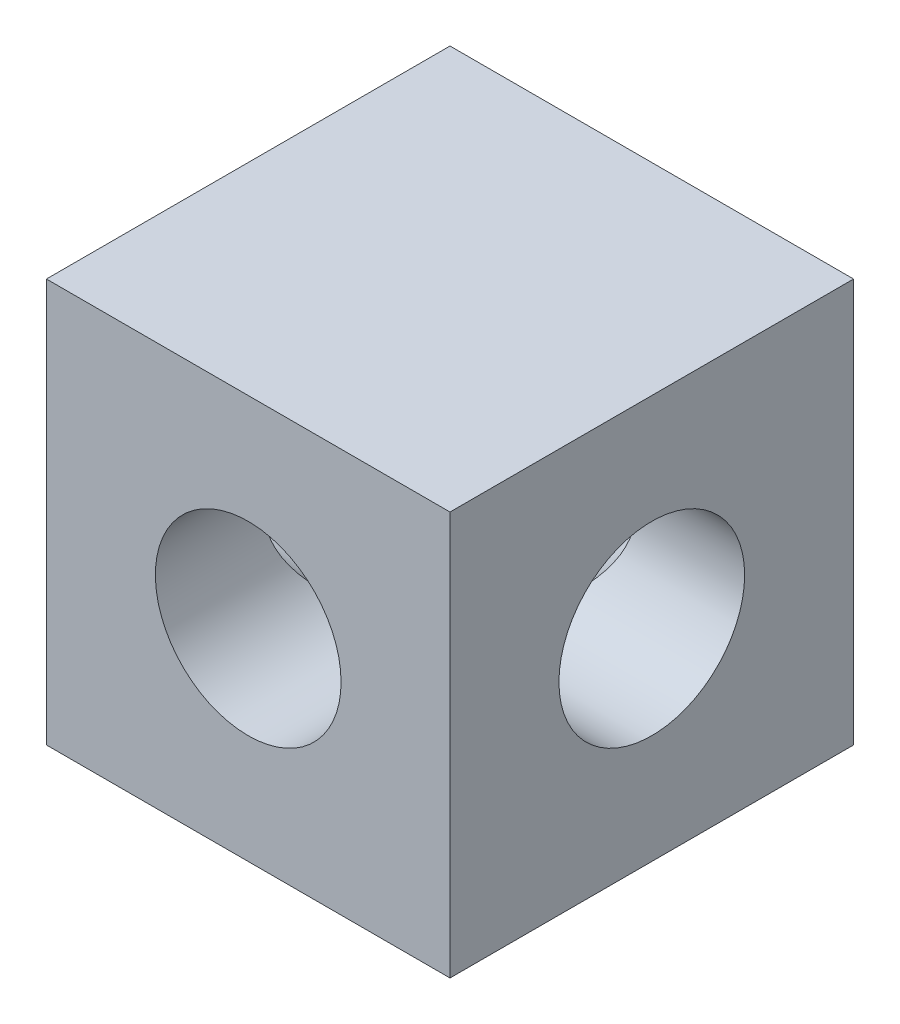
ISO-10303-21;
HEADER;
FILE_DESCRIPTION(('STEP AP214'),'2;1');
FILE_NAME('part.step','',(''),(''),'','','');
FILE_SCHEMA(('AUTOMOTIVE_DESIGN { 1 0 10303 214 1 1 1 1 }'));
ENDSEC;
DATA;
#1=APPLICATION_CONTEXT('core data for automotive mechanical design processes');
#2=APPLICATION_PROTOCOL_DEFINITION('international standard','automotive_design',2000,#1);
#3=PRODUCT_CONTEXT('',#1,'mechanical');
#4=PRODUCT('Part','Part','',(#3));
#5=PRODUCT_RELATED_PRODUCT_CATEGORY('part','',(#4));
#6=PRODUCT_DEFINITION_FORMATION('','',#4);
#7=PRODUCT_DEFINITION_CONTEXT('part definition',#1,'design');
#8=PRODUCT_DEFINITION('design','',#6,#7);
#9=PRODUCT_DEFINITION_SHAPE('','',#8);
#10=(LENGTH_UNIT() NAMED_UNIT(*) SI_UNIT(.MILLI.,.METRE.));
#11=(NAMED_UNIT(*) PLANE_ANGLE_UNIT() SI_UNIT($,.RADIAN.));
#12=(NAMED_UNIT(*) SI_UNIT($,.STERADIAN.) SOLID_ANGLE_UNIT());
#13=UNCERTAINTY_MEASURE_WITH_UNIT(LENGTH_MEASURE(1.E-05),#10,'distance_accuracy_value','');
#14=(GEOMETRIC_REPRESENTATION_CONTEXT(3) GLOBAL_UNCERTAINTY_ASSIGNED_CONTEXT((#13)) GLOBAL_UNIT_ASSIGNED_CONTEXT((#10,
#11,#12)) REPRESENTATION_CONTEXT('',''));
#15=CARTESIAN_POINT('',(0.,0.,0.));
#16=DIRECTION('',(0.,0.,1.));
#17=DIRECTION('',(1.,0.,0.));
#18=AXIS2_PLACEMENT_3D('',#15,#16,#17);
#19=CARTESIAN_POINT('',(0.,0.,20.32));
#20=DIRECTION('',(0.,0.,-1.));
#21=DIRECTION('',(-1.,0.,0.));
#22=AXIS2_PLACEMENT_3D('',#19,#20,#21);
#23=CYLINDRICAL_SURFACE('',#22,4.675);
#24=CARTESIAN_POINT('',(0.,0.,10.16));
#25=DIRECTION('',(0.707106781186547,0.,-0.707106781186547));
#26=DIRECTION('',(-0.707106781186547,0.,-0.707106781186547));
#27=AXIS2_PLACEMENT_3D('',#24,#25,#26);
#28=ELLIPSE('',#27,6.61144840409422,4.675);
#29=CARTESIAN_POINT('',(0.,-4.675,10.16));
#30=VERTEX_POINT('',#29);
#31=CARTESIAN_POINT('',(0.,4.675,10.16));
#32=VERTEX_POINT('',#31);
#33=EDGE_CURVE('E11',#30,#32,#28,.F.);
#34=ORIENTED_EDGE('',*,*,#33,.F.);
#35=CARTESIAN_POINT('',(0.,0.,10.16));
#36=DIRECTION('',(-0.707106781186547,0.,-0.707106781186547));
#37=DIRECTION('',(0.707106781186547,0.,-0.707106781186547));
#38=AXIS2_PLACEMENT_3D('',#35,#36,#37);
#39=ELLIPSE('',#38,6.61144840409422,4.675);
#40=EDGE_CURVE('E56',#32,#30,#39,.F.);
#41=ORIENTED_EDGE('',*,*,#40,.F.);
#42=EDGE_LOOP('',(#34,#41));
#43=FACE_BOUND('',#42,.T.);
#44=CARTESIAN_POINT('',(0.,0.,20.32));
#45=DIRECTION('',(0.,0.,1.));
#46=DIRECTION('',(1.,0.,0.));
#47=AXIS2_PLACEMENT_3D('',#44,#45,#46);
#48=CIRCLE('',#47,4.675);
#49=CARTESIAN_POINT('',(4.675,0.,20.32));
#50=VERTEX_POINT('',#49);
#51=EDGE_CURVE('E142',#50,#50,#48,.T.);
#52=ORIENTED_EDGE('',*,*,#51,.T.);
#53=EDGE_LOOP('',(#52));
#54=FACE_BOUND('',#53,.T.);
#55=ADVANCED_FACE('F41',(#43,#54),#23,.F.);
#56=CARTESIAN_POINT('',(0.,0.,20.32));
#57=DIRECTION('',(0.,0.,-1.));
#58=DIRECTION('',(-1.,0.,0.));
#59=AXIS2_PLACEMENT_3D('',#56,#57,#58);
#60=PLANE('',#59);
#61=DIRECTION('',(0.,1.,0.));
#62=VECTOR('',#61,1.);
#63=CARTESIAN_POINT('',(10.16,-10.16,20.32));
#64=LINE('',#63,#62);
#65=CARTESIAN_POINT('',(10.16,-10.16,20.32));
#66=VERTEX_POINT('',#65);
#67=CARTESIAN_POINT('',(10.16,10.16,20.32));
#68=VERTEX_POINT('',#67);
#69=EDGE_CURVE('E131',#66,#68,#64,.T.);
#70=ORIENTED_EDGE('',*,*,#69,.T.);
#71=DIRECTION('',(-1.,0.,0.));
#72=VECTOR('',#71,1.);
#73=CARTESIAN_POINT('',(-10.16,10.16,20.32));
#74=LINE('',#73,#72);
#75=CARTESIAN_POINT('',(-10.16,10.16,20.32));
#76=VERTEX_POINT('',#75);
#77=EDGE_CURVE('E94',#68,#76,#74,.T.);
#78=ORIENTED_EDGE('',*,*,#77,.T.);
#79=DIRECTION('',(0.,-1.,0.));
#80=VECTOR('',#79,1.);
#81=CARTESIAN_POINT('',(-10.16,-10.16,20.32));
#82=LINE('',#81,#80);
#83=CARTESIAN_POINT('',(-10.16,-10.16,20.32));
#84=VERTEX_POINT('',#83);
#85=EDGE_CURVE('E145',#76,#84,#82,.T.);
#86=ORIENTED_EDGE('',*,*,#85,.T.);
#87=DIRECTION('',(1.,0.,0.));
#88=VECTOR('',#87,1.);
#89=CARTESIAN_POINT('',(-10.16,-10.16,20.32));
#90=LINE('',#89,#88);
#91=EDGE_CURVE('E65',#84,#66,#90,.T.);
#92=ORIENTED_EDGE('',*,*,#91,.T.);
#93=EDGE_LOOP('',(#70,#78,#86,#92));
#94=FACE_BOUND('',#93,.T.);
#95=ORIENTED_EDGE('',*,*,#51,.F.);
#96=EDGE_LOOP('',(#95));
#97=FACE_BOUND('',#96,.T.);
#98=ADVANCED_FACE('F187',(#94,#97),#60,.F.);
#99=CARTESIAN_POINT('',(0.,0.,0.));
#100=DIRECTION('',(0.,0.,-1.));
#101=DIRECTION('',(-1.,0.,0.));
#102=AXIS2_PLACEMENT_3D('',#99,#100,#101);
#103=PLANE('',#102);
#104=DIRECTION('',(0.,1.,0.));
#105=VECTOR('',#104,1.);
#106=CARTESIAN_POINT('',(10.16,-10.16,0.));
#107=LINE('',#106,#105);
#108=CARTESIAN_POINT('',(10.16,-10.16,0.));
#109=VERTEX_POINT('',#108);
#110=CARTESIAN_POINT('',(10.16,10.16,0.));
#111=VERTEX_POINT('',#110);
#112=EDGE_CURVE('E138',#109,#111,#107,.T.);
#113=ORIENTED_EDGE('',*,*,#112,.F.);
#114=DIRECTION('',(1.,0.,0.));
#115=VECTOR('',#114,1.);
#116=CARTESIAN_POINT('',(-10.16,-10.16,0.));
#117=LINE('',#116,#115);
#118=CARTESIAN_POINT('',(-10.16,-10.16,0.));
#119=VERTEX_POINT('',#118);
#120=EDGE_CURVE('E86',#119,#109,#117,.T.);
#121=ORIENTED_EDGE('',*,*,#120,.F.);
#122=DIRECTION('',(0.,-1.,0.));
#123=VECTOR('',#122,1.);
#124=CARTESIAN_POINT('',(-10.16,-10.16,0.));
#125=LINE('',#124,#123);
#126=CARTESIAN_POINT('',(-10.16,10.16,0.));
#127=VERTEX_POINT('',#126);
#128=EDGE_CURVE('E132',#127,#119,#125,.T.);
#129=ORIENTED_EDGE('',*,*,#128,.F.);
#130=DIRECTION('',(-1.,0.,0.));
#131=VECTOR('',#130,1.);
#132=CARTESIAN_POINT('',(-10.16,10.16,0.));
#133=LINE('',#132,#131);
#134=EDGE_CURVE('E135',#111,#127,#133,.T.);
#135=ORIENTED_EDGE('',*,*,#134,.F.);
#136=EDGE_LOOP('',(#113,#121,#129,#135));
#137=FACE_BOUND('',#136,.T.);
#138=CARTESIAN_POINT('',(0.,0.,0.));
#139=DIRECTION('',(0.,0.,1.));
#140=DIRECTION('',(1.,0.,0.));
#141=AXIS2_PLACEMENT_3D('',#138,#139,#140);
#142=CIRCLE('',#141,4.675);
#143=CARTESIAN_POINT('',(4.675,0.,0.));
#144=VERTEX_POINT('',#143);
#145=EDGE_CURVE('E152',#144,#144,#142,.T.);
#146=ORIENTED_EDGE('',*,*,#145,.T.);
#147=EDGE_LOOP('',(#146));
#148=FACE_BOUND('',#147,.T.);
#149=ADVANCED_FACE('F171',(#137,#148),#103,.T.);
#150=CARTESIAN_POINT('',(10.16,-10.16,20.32));
#151=DIRECTION('',(-1.,0.,0.));
#152=DIRECTION('',(0.,0.,1.));
#153=AXIS2_PLACEMENT_3D('',#150,#151,#152);
#154=PLANE('',#153);
#155=CARTESIAN_POINT('',(10.16,0.,10.16));
#156=DIRECTION('',(1.,0.,0.));
#157=DIRECTION('',(0.,0.,-1.));
#158=AXIS2_PLACEMENT_3D('',#155,#156,#157);
#159=CIRCLE('',#158,4.675);
#160=CARTESIAN_POINT('',(10.16,0.,5.485));
#161=VERTEX_POINT('',#160);
#162=EDGE_CURVE('E163',#161,#161,#159,.T.);
#163=ORIENTED_EDGE('',*,*,#162,.F.);
#164=EDGE_LOOP('',(#163));
#165=FACE_BOUND('',#164,.T.);
#166=ORIENTED_EDGE('',*,*,#112,.T.);
#167=DIRECTION('',(0.,0.,-1.));
#168=VECTOR('',#167,1.);
#169=CARTESIAN_POINT('',(10.16,10.16,20.32));
#170=LINE('',#169,#168);
#171=EDGE_CURVE('E110',#68,#111,#170,.T.);
#172=ORIENTED_EDGE('',*,*,#171,.F.);
#173=ORIENTED_EDGE('',*,*,#69,.F.);
#174=DIRECTION('',(0.,0.,-1.));
#175=VECTOR('',#174,1.);
#176=CARTESIAN_POINT('',(10.16,-10.16,20.32));
#177=LINE('',#176,#175);
#178=EDGE_CURVE('E126',#66,#109,#177,.T.);
#179=ORIENTED_EDGE('',*,*,#178,.T.);
#180=EDGE_LOOP('',(#166,#172,#173,#179));
#181=FACE_BOUND('',#180,.T.);
#182=ADVANCED_FACE('F43',(#165,#181),#154,.F.);
#183=CARTESIAN_POINT('',(-10.16,10.16,20.32));
#184=DIRECTION('',(0.,-1.,0.));
#185=DIRECTION('',(0.,0.,-1.));
#186=AXIS2_PLACEMENT_3D('',#183,#184,#185);
#187=PLANE('',#186);
#188=ORIENTED_EDGE('',*,*,#134,.T.);
#189=DIRECTION('',(0.,0.,-1.));
#190=VECTOR('',#189,1.);
#191=CARTESIAN_POINT('',(-10.16,10.16,20.32));
#192=LINE('',#191,#190);
#193=EDGE_CURVE('E119',#76,#127,#192,.T.);
#194=ORIENTED_EDGE('',*,*,#193,.F.);
#195=ORIENTED_EDGE('',*,*,#77,.F.);
#196=ORIENTED_EDGE('',*,*,#171,.T.);
#197=EDGE_LOOP('',(#188,#194,#195,#196));
#198=FACE_BOUND('',#197,.T.);
#199=ADVANCED_FACE('F170',(#198),#187,.F.);
#200=CARTESIAN_POINT('',(-10.16,-10.16,20.32));
#201=DIRECTION('',(1.,0.,0.));
#202=DIRECTION('',(0.,0.,-1.));
#203=AXIS2_PLACEMENT_3D('',#200,#201,#202);
#204=PLANE('',#203);
#205=CARTESIAN_POINT('',(-10.16,0.,10.16));
#206=DIRECTION('',(1.,0.,0.));
#207=DIRECTION('',(0.,0.,-1.));
#208=AXIS2_PLACEMENT_3D('',#205,#206,#207);
#209=CIRCLE('',#208,4.675);
#210=CARTESIAN_POINT('',(-10.16,0.,5.485));
#211=VERTEX_POINT('',#210);
#212=EDGE_CURVE('E156',#211,#211,#209,.T.);
#213=ORIENTED_EDGE('',*,*,#212,.T.);
#214=EDGE_LOOP('',(#213));
#215=FACE_BOUND('',#214,.T.);
#216=ORIENTED_EDGE('',*,*,#128,.T.);
#217=DIRECTION('',(0.,0.,-1.));
#218=VECTOR('',#217,1.);
#219=CARTESIAN_POINT('',(-10.16,-10.16,20.32));
#220=LINE('',#219,#218);
#221=EDGE_CURVE('E123',#84,#119,#220,.T.);
#222=ORIENTED_EDGE('',*,*,#221,.F.);
#223=ORIENTED_EDGE('',*,*,#85,.F.);
#224=ORIENTED_EDGE('',*,*,#193,.T.);
#225=EDGE_LOOP('',(#216,#222,#223,#224));
#226=FACE_BOUND('',#225,.T.);
#227=ADVANCED_FACE('F179',(#215,#226),#204,.F.);
#228=CARTESIAN_POINT('',(-10.16,-10.16,20.32));
#229=DIRECTION('',(0.,1.,0.));
#230=DIRECTION('',(0.,0.,1.));
#231=AXIS2_PLACEMENT_3D('',#228,#229,#230);
#232=PLANE('',#231);
#233=ORIENTED_EDGE('',*,*,#120,.T.);
#234=ORIENTED_EDGE('',*,*,#178,.F.);
#235=ORIENTED_EDGE('',*,*,#91,.F.);
#236=ORIENTED_EDGE('',*,*,#221,.T.);
#237=EDGE_LOOP('',(#233,#234,#235,#236));
#238=FACE_BOUND('',#237,.T.);
#239=ADVANCED_FACE('F183',(#238),#232,.F.);
#240=CARTESIAN_POINT('',(0.,0.,10.16));
#241=DIRECTION('',(0.707106781186547,0.,-0.707106781186547));
#242=DIRECTION('',(-0.707106781186547,0.,-0.707106781186547));
#243=AXIS2_PLACEMENT_3D('',#240,#241,#242);
#244=ELLIPSE('',#243,6.61144840409422,4.675);
#245=EDGE_CURVE('E50',#30,#32,#244,.T.);
#246=ORIENTED_EDGE('',*,*,#245,.F.);
#247=CARTESIAN_POINT('',(0.,0.,10.16));
#248=DIRECTION('',(-0.707106781186547,0.,-0.707106781186547));
#249=DIRECTION('',(0.707106781186547,0.,-0.707106781186547));
#250=AXIS2_PLACEMENT_3D('',#247,#248,#249);
#251=ELLIPSE('',#250,6.61144840409422,4.675);
#252=EDGE_CURVE('E99',#32,#30,#251,.T.);
#253=ORIENTED_EDGE('',*,*,#252,.F.);
#254=EDGE_LOOP('',(#246,#253));
#255=FACE_BOUND('',#254,.T.);
#256=ORIENTED_EDGE('',*,*,#145,.F.);
#257=EDGE_LOOP('',(#256));
#258=FACE_BOUND('',#257,.T.);
#259=ADVANCED_FACE('F113',(#255,#258),#23,.F.);
#260=CARTESIAN_POINT('',(10.16,0.,10.16));
#261=DIRECTION('',(1.,0.,0.));
#262=DIRECTION('',(0.,0.,-1.));
#263=AXIS2_PLACEMENT_3D('',#260,#261,#262);
#264=CYLINDRICAL_SURFACE('',#263,4.675);
#265=ORIENTED_EDGE('',*,*,#245,.T.);
#266=ORIENTED_EDGE('',*,*,#40,.T.);
#267=EDGE_LOOP('',(#265,#266));
#268=FACE_BOUND('',#267,.T.);
#269=ORIENTED_EDGE('',*,*,#212,.F.);
#270=EDGE_LOOP('',(#269));
#271=FACE_BOUND('',#270,.T.);
#272=ADVANCED_FACE('F107',(#268,#271),#264,.F.);
#273=ORIENTED_EDGE('',*,*,#33,.T.);
#274=ORIENTED_EDGE('',*,*,#252,.T.);
#275=EDGE_LOOP('',(#273,#274));
#276=FACE_BOUND('',#275,.T.);
#277=ORIENTED_EDGE('',*,*,#162,.T.);
#278=EDGE_LOOP('',(#277));
#279=FACE_BOUND('',#278,.T.);
#280=ADVANCED_FACE('F100',(#276,#279),#264,.F.);
#281=CLOSED_SHELL('',(#55,#98,#149,#182,#199,#227,#239,#259,#272,#280));
#282=MANIFOLD_SOLID_BREP('B2',#281);
#283=ADVANCED_BREP_SHAPE_REPRESENTATION('',(#18,#282),#14);
#284=SHAPE_DEFINITION_REPRESENTATION(#9,#283);
ENDSEC;
END-ISO-10303-21;
